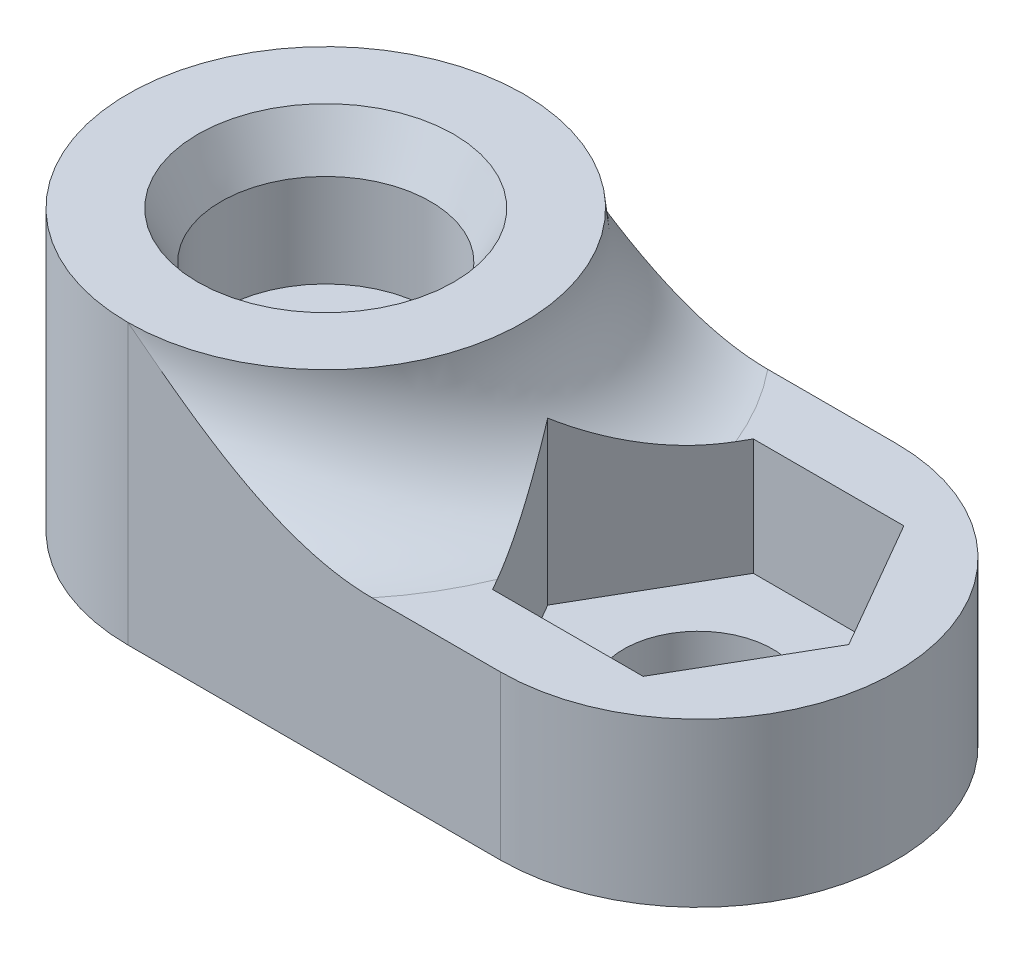
ISO-10303-21;
HEADER;
FILE_DESCRIPTION(('STEP AP214'),'2;1');
FILE_NAME('part.step','',(''),(''),'','','');
FILE_SCHEMA(('AUTOMOTIVE_DESIGN { 1 0 10303 214 1 1 1 1 }'));
ENDSEC;
DATA;
#1=APPLICATION_CONTEXT('core data for automotive mechanical design processes');
#2=APPLICATION_PROTOCOL_DEFINITION('international standard','automotive_design',2000,#1);
#3=PRODUCT_CONTEXT('',#1,'mechanical');
#4=PRODUCT('Part','Part','',(#3));
#5=PRODUCT_RELATED_PRODUCT_CATEGORY('part','',(#4));
#6=PRODUCT_DEFINITION_FORMATION('','',#4);
#7=PRODUCT_DEFINITION_CONTEXT('part definition',#1,'design');
#8=PRODUCT_DEFINITION('design','',#6,#7);
#9=PRODUCT_DEFINITION_SHAPE('','',#8);
#10=(LENGTH_UNIT() NAMED_UNIT(*) SI_UNIT(.MILLI.,.METRE.));
#11=(NAMED_UNIT(*) PLANE_ANGLE_UNIT() SI_UNIT($,.RADIAN.));
#12=(NAMED_UNIT(*) SI_UNIT($,.STERADIAN.) SOLID_ANGLE_UNIT());
#13=UNCERTAINTY_MEASURE_WITH_UNIT(LENGTH_MEASURE(1.E-05),#10,'distance_accuracy_value','');
#14=(GEOMETRIC_REPRESENTATION_CONTEXT(3) GLOBAL_UNCERTAINTY_ASSIGNED_CONTEXT((#13)) GLOBAL_UNIT_ASSIGNED_CONTEXT((#10,
#11,#12)) REPRESENTATION_CONTEXT('',''));
#15=CARTESIAN_POINT('',(0.,0.,0.));
#16=DIRECTION('',(0.,0.,1.));
#17=DIRECTION('',(1.,0.,0.));
#18=AXIS2_PLACEMENT_3D('',#15,#16,#17);
#19=CARTESIAN_POINT('',(-4.,6.,4.25));
#20=DIRECTION('',(0.,0.,-1.));
#21=DIRECTION('',(-1.,0.,0.));
#22=AXIS2_PLACEMENT_3D('',#19,#20,#21);
#23=PLANE('',#22);
#24=DIRECTION('',(1.,0.,0.));
#25=VECTOR('',#24,1.);
#26=CARTESIAN_POINT('',(-4.,3.5,4.25));
#27=LINE('',#26,#25);
#28=CARTESIAN_POINT('',(1.24404424085076,3.5,4.25));
#29=VERTEX_POINT('',#28);
#30=CARTESIAN_POINT('',(4.,3.5,4.25));
#31=VERTEX_POINT('',#30);
#32=EDGE_CURVE('E129',#29,#31,#27,.T.);
#33=ORIENTED_EDGE('',*,*,#32,.F.);
#34=CARTESIAN_POINT('',(1.24404424085076,3.5,4.25));
#35=CARTESIAN_POINT('',(1.10810369469074,3.50000373529834,4.25));
#36=CARTESIAN_POINT('',(0.972308352707414,3.50668920022554,4.25));
#37=CARTESIAN_POINT('',(0.702103297734981,3.53214344116817,4.25));
#38=CARTESIAN_POINT('',(0.567691406935837,3.5508887395514,4.25));
#39=CARTESIAN_POINT('',(0.171184944719958,3.62265462839746,4.25));
#40=CARTESIAN_POINT('',(-0.0880999173191222,3.6912817218382,4.25));
#41=CARTESIAN_POINT('',(-0.761211941456565,3.916832916689,4.25));
#42=CARTESIAN_POINT('',(-1.16527462955748,4.10215086489756,4.25));
#43=CARTESIAN_POINT('',(-1.7490638887413,4.42108288826862,4.25));
#44=CARTESIAN_POINT('',(-1.94067201163178,4.53476342555109,4.25));
#45=CARTESIAN_POINT('',(-2.31751508364871,4.77230159065795,4.25));
#46=CARTESIAN_POINT('',(-2.5027510754478,4.89615754213183,4.25));
#47=CARTESIAN_POINT('',(-3.12997398815831,5.33287181374285,4.25));
#48=CARTESIAN_POINT('',(-3.55998016095011,5.66252138297456,4.25));
#49=CARTESIAN_POINT('',(-3.99310276690116,5.99471006991551,4.25));
#50=CARTESIAN_POINT('',(-3.99655139050899,5.99735504361978,4.25));
#51=CARTESIAN_POINT('',(-4.,6.,4.25));
#52=B_SPLINE_CURVE_WITH_KNOTS('',3,(#34,#35,#36,#37,#38,#39,#40,#41,#42,#43,#44,#45,#46,#47,#48,
#49,#50,#51),.UNSPECIFIED.,.F.,.F.,(4,2,2,2,2,2,2,2,4),(0.,0.407433150558249,0.814075515832789,
1.61575218557037,2.94144234670956,3.60971583356349,4.27787944550394,5.90236182275991,
5.9154002275773),.UNSPECIFIED.);
#53=CARTESIAN_POINT('',(-4.,6.,4.25));
#54=VERTEX_POINT('',#53);
#55=EDGE_CURVE('E191',#29,#54,#52,.T.);
#56=ORIENTED_EDGE('',*,*,#55,.T.);
#57=DIRECTION('',(0.,-1.,0.));
#58=VECTOR('',#57,1.);
#59=CARTESIAN_POINT('',(-4.,6.,4.25));
#60=LINE('',#59,#58);
#61=CARTESIAN_POINT('',(-4.,0.,4.25));
#62=VERTEX_POINT('',#61);
#63=EDGE_CURVE('E146',#54,#62,#60,.T.);
#64=ORIENTED_EDGE('',*,*,#63,.T.);
#65=DIRECTION('',(1.,0.,0.));
#66=VECTOR('',#65,1.);
#67=CARTESIAN_POINT('',(-4.,0.,4.25));
#68=LINE('',#67,#66);
#69=CARTESIAN_POINT('',(4.,0.,4.25));
#70=VERTEX_POINT('',#69);
#71=EDGE_CURVE('E239',#62,#70,#68,.T.);
#72=ORIENTED_EDGE('',*,*,#71,.T.);
#73=DIRECTION('',(0.,-1.,0.));
#74=VECTOR('',#73,1.);
#75=CARTESIAN_POINT('',(4.,6.,4.25));
#76=LINE('',#75,#74);
#77=EDGE_CURVE('E144',#31,#70,#76,.T.);
#78=ORIENTED_EDGE('',*,*,#77,.F.);
#79=EDGE_LOOP('',(#33,#56,#64,#72,#78));
#80=FACE_BOUND('',#79,.T.);
#81=ADVANCED_FACE('F33',(#80),#23,.F.);
#82=CARTESIAN_POINT('',(4.,6.,0.));
#83=DIRECTION('',(0.,-1.,0.));
#84=DIRECTION('',(0.,0.,-1.));
#85=AXIS2_PLACEMENT_3D('',#82,#83,#84);
#86=CYLINDRICAL_SURFACE('',#85,4.25);
#87=CARTESIAN_POINT('',(4.,3.5,0.));
#88=DIRECTION('',(0.,1.,0.));
#89=DIRECTION('',(0.,0.,1.));
#90=AXIS2_PLACEMENT_3D('',#87,#88,#89);
#91=CIRCLE('',#90,4.25);
#92=CARTESIAN_POINT('',(4.,3.5,-4.25));
#93=VERTEX_POINT('',#92);
#94=EDGE_CURVE('E122',#31,#93,#91,.T.);
#95=ORIENTED_EDGE('',*,*,#94,.F.);
#96=ORIENTED_EDGE('',*,*,#77,.T.);
#97=CARTESIAN_POINT('',(4.,0.,0.));
#98=DIRECTION('',(0.,1.,0.));
#99=DIRECTION('',(0.,0.,1.));
#100=AXIS2_PLACEMENT_3D('',#97,#98,#99);
#101=CIRCLE('',#100,4.25);
#102=CARTESIAN_POINT('',(4.,0.,-4.25));
#103=VERTEX_POINT('',#102);
#104=EDGE_CURVE('E142',#70,#103,#101,.T.);
#105=ORIENTED_EDGE('',*,*,#104,.T.);
#106=DIRECTION('',(0.,-1.,0.));
#107=VECTOR('',#106,1.);
#108=CARTESIAN_POINT('',(4.,6.,-4.25));
#109=LINE('',#108,#107);
#110=EDGE_CURVE('E135',#93,#103,#109,.T.);
#111=ORIENTED_EDGE('',*,*,#110,.F.);
#112=EDGE_LOOP('',(#95,#96,#105,#111));
#113=FACE_BOUND('',#112,.T.);
#114=ADVANCED_FACE('F140',(#113),#86,.T.);
#115=CARTESIAN_POINT('',(-4.,6.,-4.25));
#116=DIRECTION('',(0.,0.,1.));
#117=DIRECTION('',(1.,0.,0.));
#118=AXIS2_PLACEMENT_3D('',#115,#116,#117);
#119=PLANE('',#118);
#120=DIRECTION('',(-1.,0.,0.));
#121=VECTOR('',#120,1.);
#122=CARTESIAN_POINT('',(4.,3.5,-4.25));
#123=LINE('',#122,#121);
#124=CARTESIAN_POINT('',(1.24404424085076,3.5,-4.25));
#125=VERTEX_POINT('',#124);
#126=EDGE_CURVE('E126',#93,#125,#123,.T.);
#127=ORIENTED_EDGE('',*,*,#126,.F.);
#128=ORIENTED_EDGE('',*,*,#110,.T.);
#129=DIRECTION('',(-1.,0.,0.));
#130=VECTOR('',#129,1.);
#131=CARTESIAN_POINT('',(-4.,0.,-4.25));
#132=LINE('',#131,#130);
#133=CARTESIAN_POINT('',(-4.,0.,-4.25));
#134=VERTEX_POINT('',#133);
#135=EDGE_CURVE('E232',#103,#134,#132,.T.);
#136=ORIENTED_EDGE('',*,*,#135,.T.);
#137=DIRECTION('',(0.,-1.,0.));
#138=VECTOR('',#137,1.);
#139=CARTESIAN_POINT('',(-4.,6.,-4.25));
#140=LINE('',#139,#138);
#141=CARTESIAN_POINT('',(-4.,6.,-4.25));
#142=VERTEX_POINT('',#141);
#143=EDGE_CURVE('E56',#142,#134,#140,.T.);
#144=ORIENTED_EDGE('',*,*,#143,.F.);
#145=CARTESIAN_POINT('',(1.24404424085076,3.5,-4.25));
#146=CARTESIAN_POINT('',(1.10810369469074,3.50000373529834,-4.25));
#147=CARTESIAN_POINT('',(0.972308352707407,3.50668920022554,-4.25));
#148=CARTESIAN_POINT('',(0.70210329773497,3.53214344116817,-4.25));
#149=CARTESIAN_POINT('',(0.567691406935824,3.5508887395514,-4.25));
#150=CARTESIAN_POINT('',(0.171184944719949,3.62265462839746,-4.25));
#151=CARTESIAN_POINT('',(-0.0880999173191279,3.6912817218382,-4.25));
#152=CARTESIAN_POINT('',(-0.761211941456561,3.916832916689,-4.25));
#153=CARTESIAN_POINT('',(-1.16527462955747,4.10215086489756,-4.25));
#154=CARTESIAN_POINT('',(-1.7490638887413,4.42108288826862,-4.25));
#155=CARTESIAN_POINT('',(-1.94067201163177,4.53476342555108,-4.25));
#156=CARTESIAN_POINT('',(-2.3175150836487,4.77230159065795,-4.25));
#157=CARTESIAN_POINT('',(-2.50275107544778,4.89615754213184,-4.25));
#158=CARTESIAN_POINT('',(-3.12997398815833,5.33287181374282,-4.25));
#159=CARTESIAN_POINT('',(-3.55998016095025,5.66252138297438,-4.25));
#160=CARTESIAN_POINT('',(-3.99310276690116,5.99471006991551,-4.25));
#161=CARTESIAN_POINT('',(-3.99655139050899,5.99735504361978,-4.25));
#162=CARTESIAN_POINT('',(-4.,6.,-4.25));
#163=B_SPLINE_CURVE_WITH_KNOTS('',3,(#145,#146,#147,#148,#149,#150,#151,#152,#153,#154,#155,
#156,#157,#158,#159,#160,#161,#162),.UNSPECIFIED.,.F.,.F.,(4,2,2,2,2,2,2,2,4),(0.,
0.407433150558256,0.814075515832802,1.61575218557036,2.94144234670955,3.60971583356348,
4.27787944550393,5.90236182275991,5.9154002275773),.UNSPECIFIED.);
#164=EDGE_CURVE('E138',#142,#125,#163,.F.);
#165=ORIENTED_EDGE('',*,*,#164,.T.);
#166=EDGE_LOOP('',(#127,#128,#136,#144,#165));
#167=FACE_BOUND('',#166,.T.);
#168=ADVANCED_FACE('F134',(#167),#119,.F.);
#169=CARTESIAN_POINT('',(5.61658075373095,1.,2.8));
#170=DIRECTION('',(0.866025403784438,0.,0.5));
#171=DIRECTION('',(0.5,0.,-0.866025403784439));
#172=AXIS2_PLACEMENT_3D('',#169,#170,#171);
#173=PLANE('',#172);
#174=DIRECTION('',(-0.5,0.,0.866025403784439));
#175=VECTOR('',#174,1.);
#176=CARTESIAN_POINT('',(5.61658075373095,3.5,2.8));
#177=LINE('',#176,#175);
#178=CARTESIAN_POINT('',(7.23316150746191,3.5,0.));
#179=VERTEX_POINT('',#178);
#180=CARTESIAN_POINT('',(5.61658075373095,3.5,2.8));
#181=VERTEX_POINT('',#180);
#182=EDGE_CURVE('E416',#179,#181,#177,.T.);
#183=ORIENTED_EDGE('',*,*,#182,.F.);
#184=DIRECTION('',(0.,1.,0.));
#185=VECTOR('',#184,1.);
#186=CARTESIAN_POINT('',(7.23316150746191,1.,0.));
#187=LINE('',#186,#185);
#188=CARTESIAN_POINT('',(7.23316150746191,1.,0.));
#189=VERTEX_POINT('',#188);
#190=EDGE_CURVE('E382',#189,#179,#187,.T.);
#191=ORIENTED_EDGE('',*,*,#190,.F.);
#192=DIRECTION('',(0.5,0.,-0.866025403784439));
#193=VECTOR('',#192,1.);
#194=CARTESIAN_POINT('',(5.61658075373095,1.,2.8));
#195=LINE('',#194,#193);
#196=CARTESIAN_POINT('',(5.61658075373095,1.,2.8));
#197=VERTEX_POINT('',#196);
#198=EDGE_CURVE('E409',#197,#189,#195,.T.);
#199=ORIENTED_EDGE('',*,*,#198,.F.);
#200=DIRECTION('',(0.,1.,0.));
#201=VECTOR('',#200,1.);
#202=CARTESIAN_POINT('',(5.61658075373095,1.,2.8));
#203=LINE('',#202,#201);
#204=EDGE_CURVE('E375',#197,#181,#203,.T.);
#205=ORIENTED_EDGE('',*,*,#204,.T.);
#206=EDGE_LOOP('',(#183,#191,#199,#205));
#207=FACE_BOUND('',#206,.T.);
#208=ADVANCED_FACE('F256',(#207),#173,.F.);
#209=CARTESIAN_POINT('',(2.38341924626905,1.,2.8));
#210=DIRECTION('',(0.,0.,1.));
#211=DIRECTION('',(1.,0.,0.));
#212=AXIS2_PLACEMENT_3D('',#209,#210,#211);
#213=PLANE('',#212);
#214=DIRECTION('',(-1.,0.,0.));
#215=VECTOR('',#214,1.);
#216=CARTESIAN_POINT('',(2.38341924626905,3.5,2.8));
#217=LINE('',#216,#215);
#218=CARTESIAN_POINT('',(2.38341924626905,3.5,2.8));
#219=VERTEX_POINT('',#218);
#220=EDGE_CURVE('E419',#181,#219,#217,.T.);
#221=ORIENTED_EDGE('',*,*,#220,.F.);
#222=ORIENTED_EDGE('',*,*,#204,.F.);
#223=DIRECTION('',(1.,0.,0.));
#224=VECTOR('',#223,1.);
#225=CARTESIAN_POINT('',(2.38341924626905,1.,2.8));
#226=LINE('',#225,#224);
#227=CARTESIAN_POINT('',(2.38341924626905,1.,2.8));
#228=VERTEX_POINT('',#227);
#229=EDGE_CURVE('E386',#228,#197,#226,.T.);
#230=ORIENTED_EDGE('',*,*,#229,.F.);
#231=DIRECTION('',(0.,1.,0.));
#232=VECTOR('',#231,1.);
#233=CARTESIAN_POINT('',(2.38341924626905,1.,2.8));
#234=LINE('',#233,#232);
#235=EDGE_CURVE('E379',#228,#219,#234,.T.);
#236=ORIENTED_EDGE('',*,*,#235,.T.);
#237=EDGE_LOOP('',(#221,#222,#230,#236));
#238=FACE_BOUND('',#237,.T.);
#239=ADVANCED_FACE('F261',(#238),#213,.F.);
#240=CARTESIAN_POINT('',(0.766838492538096,1.,0.));
#241=DIRECTION('',(-0.866025403784439,0.,0.5));
#242=DIRECTION('',(0.5,0.,0.866025403784439));
#243=AXIS2_PLACEMENT_3D('',#240,#241,#242);
#244=PLANE('',#243);
#245=DIRECTION('',(-0.5,0.,-0.866025403784439));
#246=VECTOR('',#245,1.);
#247=CARTESIAN_POINT('',(0.766838492538096,3.5,0.));
#248=LINE('',#247,#246);
#249=CARTESIAN_POINT('',(2.24535536211645,3.5,2.56086633795739));
#250=VERTEX_POINT('',#249);
#251=EDGE_CURVE('E421',#219,#250,#248,.T.);
#252=ORIENTED_EDGE('',*,*,#251,.F.);
#253=ORIENTED_EDGE('',*,*,#235,.F.);
#254=DIRECTION('',(0.5,0.,0.866025403784439));
#255=VECTOR('',#254,1.);
#256=CARTESIAN_POINT('',(0.766838492538096,1.,0.));
#257=LINE('',#256,#255);
#258=CARTESIAN_POINT('',(0.766838492538096,1.,0.));
#259=VERTEX_POINT('',#258);
#260=EDGE_CURVE('E397',#259,#228,#257,.T.);
#261=ORIENTED_EDGE('',*,*,#260,.F.);
#262=DIRECTION('',(0.,1.,0.));
#263=VECTOR('',#262,1.);
#264=CARTESIAN_POINT('',(0.766838492538096,1.,0.));
#265=LINE('',#264,#263);
#266=CARTESIAN_POINT('',(0.766838492538096,4.47780735932621,0.));
#267=VERTEX_POINT('',#266);
#268=EDGE_CURVE('E48',#259,#267,#265,.T.);
#269=ORIENTED_EDGE('',*,*,#268,.T.);
#270=CARTESIAN_POINT('',(0.766838492538096,4.47780735932621,0.));
#271=CARTESIAN_POINT('',(0.806979971242506,4.42552946597929,0.0695270806069799));
#272=CARTESIAN_POINT('',(0.847639636619182,4.37483669220918,0.139951686858131));
#273=CARTESIAN_POINT('',(0.92996543142611,4.27678785984553,0.282544146237221));
#274=CARTESIAN_POINT('',(0.971631800602003,4.22943260680985,0.35471241461679));
#275=CARTESIAN_POINT('',(1.05608288214946,4.13807630004476,0.500985978611127));
#276=CARTESIAN_POINT('',(1.09887126132079,4.09408876311847,0.575097625309393));
#277=CARTESIAN_POINT('',(1.18537209919397,4.0099422132226,0.724921471403021));
#278=CARTESIAN_POINT('',(1.22908449565245,3.96978294337219,0.8006335629897));
#279=CARTESIAN_POINT('',(1.35876989902924,3.85790090150424,1.02525527063837));
#280=CARTESIAN_POINT('',(1.4459913977252,3.79183039390045,1.17632733789207));
#281=CARTESIAN_POINT('',(1.62321325033044,3.67787796219826,1.48328459081583));
#282=CARTESIAN_POINT('',(1.71320812825547,3.6299624037551,1.63916029180294));
#283=CARTESIAN_POINT('',(1.87636744077898,3.56293971648729,1.92176051082166));
#284=CARTESIAN_POINT('',(1.94912435264408,3.53990715858,2.04777917877383));
#285=CARTESIAN_POINT('',(2.09633528669854,3.5083449200926,2.30275599598583));
#286=CARTESIAN_POINT('',(2.17079914309629,3.50000146488552,2.43173117859425));
#287=CARTESIAN_POINT('',(2.24535536211645,3.5,2.56086633795739));
#288=B_SPLINE_CURVE_WITH_KNOTS('',3,(#270,#271,#272,#273,#274,#275,#276,#277,#278,#279,#280,
#281,#282,#283,#284,#285,#286,#287),.UNSPECIFIED.,.F.,.F.,(4,2,2,2,2,2,2,2,4),(0.,
0.287396578000092,0.574862287341477,0.863427100813826,1.1519725376267,1.71067803338073,
2.26834333559797,2.70961723929042,3.15644629285671),.UNSPECIFIED.);
#289=EDGE_CURVE('E171',#267,#250,#288,.T.);
#290=ORIENTED_EDGE('',*,*,#289,.T.);
#291=EDGE_LOOP('',(#252,#253,#261,#269,#290));
#292=FACE_BOUND('',#291,.T.);
#293=ADVANCED_FACE('F287',(#292),#244,.F.);
#294=CARTESIAN_POINT('',(2.38341924626905,1.,-2.8));
#295=DIRECTION('',(-0.866025403784439,0.,-0.5));
#296=DIRECTION('',(-0.5,0.,0.866025403784439));
#297=AXIS2_PLACEMENT_3D('',#294,#295,#296);
#298=PLANE('',#297);
#299=DIRECTION('',(0.5,0.,-0.866025403784439));
#300=VECTOR('',#299,1.);
#301=CARTESIAN_POINT('',(2.38341924626905,3.5,-2.8));
#302=LINE('',#301,#300);
#303=CARTESIAN_POINT('',(2.24535536211645,3.5,-2.5608663379574));
#304=VERTEX_POINT('',#303);
#305=CARTESIAN_POINT('',(2.38341924626905,3.5,-2.8));
#306=VERTEX_POINT('',#305);
#307=EDGE_CURVE('E424',#304,#306,#302,.T.);
#308=ORIENTED_EDGE('',*,*,#307,.F.);
#309=CARTESIAN_POINT('',(2.24535536211645,3.5,-2.5608663379574));
#310=CARTESIAN_POINT('',(2.1386518497916,3.50002544341177,-2.37605043326471));
#311=CARTESIAN_POINT('',(2.03228556893531,3.51707763386974,-2.19181863060946));
#312=CARTESIAN_POINT('',(1.87527068460762,3.56440935799784,-1.91986087340935));
#313=CARTESIAN_POINT('',(1.82377619606505,3.58356336783666,-1.83066980294386));
#314=CARTESIAN_POINT('',(1.72149757742328,3.62841788399579,-1.65351803892835));
#315=CARTESIAN_POINT('',(1.67071365533229,3.65412026664479,-1.56555770565913));
#316=CARTESIAN_POINT('',(1.5455868531305,3.72545886027243,-1.34883172685702));
#317=CARTESIAN_POINT('',(1.47175661131143,3.77471847849082,-1.22095399689128));
#318=CARTESIAN_POINT('',(1.32627488931519,3.8848914394024,-0.968972262821186));
#319=CARTESIAN_POINT('',(1.25462494660488,3.94581279448426,-0.844870921687532));
#320=CARTESIAN_POINT('',(1.11192117638444,4.07958059037973,-0.597700741234095));
#321=CARTESIAN_POINT('',(1.0409296300142,4.15269252024871,-0.474739776012963));
#322=CARTESIAN_POINT('',(0.93652700203598,4.26946176996745,-0.293909119910972));
#323=CARTESIAN_POINT('',(0.902099047522551,4.30953513904567,-0.234278153493043));
#324=CARTESIAN_POINT('',(0.833941461654309,4.39197295729026,-0.116225751848009));
#325=CARTESIAN_POINT('',(0.800211745041798,4.4343371244317,-0.0578041689502406));
#326=CARTESIAN_POINT('',(0.766838492538096,4.47780735932622,0.));
#327=B_SPLINE_CURVE_WITH_KNOTS('',3,(#309,#310,#311,#312,#313,#314,#315,#316,#317,#318,#319,
#320,#321,#322,#323,#324,#325,#326),.UNSPECIFIED.,.F.,.F.,(4,2,2,2,2,2,2,2,4),(0.,
0.63850856170333,0.952540322630387,1.2666621655969,1.7330485408829,2.19975651228507,
2.67841921923753,2.91738622560714,3.15632387893702),.UNSPECIFIED.);
#328=EDGE_CURVE('E165',#304,#267,#327,.T.);
#329=ORIENTED_EDGE('',*,*,#328,.T.);
#330=ORIENTED_EDGE('',*,*,#268,.F.);
#331=DIRECTION('',(-0.5,0.,0.866025403784439));
#332=VECTOR('',#331,1.);
#333=CARTESIAN_POINT('',(2.38341924626905,1.,-2.8));
#334=LINE('',#333,#332);
#335=CARTESIAN_POINT('',(2.38341924626905,1.,-2.8));
#336=VERTEX_POINT('',#335);
#337=EDGE_CURVE('E400',#336,#259,#334,.T.);
#338=ORIENTED_EDGE('',*,*,#337,.F.);
#339=DIRECTION('',(0.,1.,0.));
#340=VECTOR('',#339,1.);
#341=CARTESIAN_POINT('',(2.38341924626905,1.,-2.8));
#342=LINE('',#341,#340);
#343=EDGE_CURVE('E389',#336,#306,#342,.T.);
#344=ORIENTED_EDGE('',*,*,#343,.T.);
#345=EDGE_LOOP('',(#308,#329,#330,#338,#344));
#346=FACE_BOUND('',#345,.T.);
#347=ADVANCED_FACE('F177',(#346),#298,.F.);
#348=CARTESIAN_POINT('',(5.61658075373095,1.,-2.8));
#349=DIRECTION('',(0.,0.,-1.));
#350=DIRECTION('',(-1.,0.,0.));
#351=AXIS2_PLACEMENT_3D('',#348,#349,#350);
#352=PLANE('',#351);
#353=DIRECTION('',(1.,0.,0.));
#354=VECTOR('',#353,1.);
#355=CARTESIAN_POINT('',(5.61658075373095,3.5,-2.8));
#356=LINE('',#355,#354);
#357=CARTESIAN_POINT('',(5.61658075373095,3.5,-2.8));
#358=VERTEX_POINT('',#357);
#359=EDGE_CURVE('E426',#306,#358,#356,.T.);
#360=ORIENTED_EDGE('',*,*,#359,.F.);
#361=ORIENTED_EDGE('',*,*,#343,.F.);
#362=DIRECTION('',(-1.,0.,0.));
#363=VECTOR('',#362,1.);
#364=CARTESIAN_POINT('',(5.61658075373095,1.,-2.8));
#365=LINE('',#364,#363);
#366=CARTESIAN_POINT('',(5.61658075373095,1.,-2.8));
#367=VERTEX_POINT('',#366);
#368=EDGE_CURVE('E403',#367,#336,#365,.T.);
#369=ORIENTED_EDGE('',*,*,#368,.F.);
#370=DIRECTION('',(0.,1.,0.));
#371=VECTOR('',#370,1.);
#372=CARTESIAN_POINT('',(5.61658075373095,1.,-2.8));
#373=LINE('',#372,#371);
#374=EDGE_CURVE('E385',#367,#358,#373,.T.);
#375=ORIENTED_EDGE('',*,*,#374,.T.);
#376=EDGE_LOOP('',(#360,#361,#369,#375));
#377=FACE_BOUND('',#376,.T.);
#378=ADVANCED_FACE('F217',(#377),#352,.F.);
#379=CARTESIAN_POINT('',(7.23316150746191,1.,0.));
#380=DIRECTION('',(0.866025403784439,0.,-0.5));
#381=DIRECTION('',(-0.5,0.,-0.866025403784439));
#382=AXIS2_PLACEMENT_3D('',#379,#380,#381);
#383=PLANE('',#382);
#384=DIRECTION('',(0.5,0.,0.866025403784439));
#385=VECTOR('',#384,1.);
#386=CARTESIAN_POINT('',(7.23316150746191,3.5,0.));
#387=LINE('',#386,#385);
#388=EDGE_CURVE('E159',#358,#179,#387,.T.);
#389=ORIENTED_EDGE('',*,*,#388,.F.);
#390=ORIENTED_EDGE('',*,*,#374,.F.);
#391=DIRECTION('',(-0.5,0.,-0.866025403784439));
#392=VECTOR('',#391,1.);
#393=CARTESIAN_POINT('',(7.23316150746191,1.,0.));
#394=LINE('',#393,#392);
#395=EDGE_CURVE('E406',#189,#367,#394,.T.);
#396=ORIENTED_EDGE('',*,*,#395,.F.);
#397=ORIENTED_EDGE('',*,*,#190,.T.);
#398=EDGE_LOOP('',(#389,#390,#396,#397));
#399=FACE_BOUND('',#398,.T.);
#400=ADVANCED_FACE('F208',(#399),#383,.F.);
#401=CARTESIAN_POINT('',(-4.,6.,0.));
#402=DIRECTION('',(0.,-1.,0.));
#403=DIRECTION('',(0.,0.,-1.));
#404=AXIS2_PLACEMENT_3D('',#401,#402,#403);
#405=CYLINDRICAL_SURFACE('',#404,4.25);
#406=ORIENTED_EDGE('',*,*,#63,.F.);
#407=CARTESIAN_POINT('',(-4.,6.,0.));
#408=DIRECTION('',(0.,1.,0.));
#409=DIRECTION('',(0.,0.,1.));
#410=AXIS2_PLACEMENT_3D('',#407,#408,#409);
#411=CIRCLE('',#410,4.25);
#412=EDGE_CURVE('E222',#142,#54,#411,.T.);
#413=ORIENTED_EDGE('',*,*,#412,.F.);
#414=ORIENTED_EDGE('',*,*,#143,.T.);
#415=CARTESIAN_POINT('',(-4.,0.,0.));
#416=DIRECTION('',(0.,1.,0.));
#417=DIRECTION('',(0.,0.,1.));
#418=AXIS2_PLACEMENT_3D('',#415,#416,#417);
#419=CIRCLE('',#418,4.25);
#420=EDGE_CURVE('E225',#134,#62,#419,.T.);
#421=ORIENTED_EDGE('',*,*,#420,.T.);
#422=EDGE_LOOP('',(#406,#413,#414,#421));
#423=FACE_BOUND('',#422,.T.);
#424=ADVANCED_FACE('F205',(#423),#405,.T.);
#425=CARTESIAN_POINT('',(-4.,6.,0.));
#426=DIRECTION('',(0.,1.,0.));
#427=DIRECTION('',(0.,0.,1.));
#428=AXIS2_PLACEMENT_3D('',#425,#426,#427);
#429=PLANE('',#428);
#430=EDGE_CURVE('E148',#54,#142,#411,.T.);
#431=ORIENTED_EDGE('',*,*,#430,.T.);
#432=ORIENTED_EDGE('',*,*,#412,.T.);
#433=EDGE_LOOP('',(#431,#432));
#434=FACE_BOUND('',#433,.T.);
#435=CARTESIAN_POINT('',(-4.,6.,0.));
#436=DIRECTION('',(0.,1.,0.));
#437=DIRECTION('',(0.,0.,1.));
#438=AXIS2_PLACEMENT_3D('',#435,#436,#437);
#439=CIRCLE('',#438,2.75);
#440=CARTESIAN_POINT('',(-4.,6.,2.75));
#441=VERTEX_POINT('',#440);
#442=EDGE_CURVE('E156',#441,#441,#439,.F.);
#443=ORIENTED_EDGE('',*,*,#442,.T.);
#444=EDGE_LOOP('',(#443));
#445=FACE_BOUND('',#444,.T.);
#446=ADVANCED_FACE('F207',(#434,#445),#429,.T.);
#447=CARTESIAN_POINT('',(-4.,0.,0.));
#448=DIRECTION('',(0.,1.,0.));
#449=DIRECTION('',(0.,0.,1.));
#450=AXIS2_PLACEMENT_3D('',#447,#448,#449);
#451=PLANE('',#450);
#452=CARTESIAN_POINT('',(4.,0.,0.));
#453=DIRECTION('',(0.,1.,0.));
#454=DIRECTION('',(0.,0.,1.));
#455=AXIS2_PLACEMENT_3D('',#452,#453,#454);
#456=CIRCLE('',#455,1.6);
#457=CARTESIAN_POINT('',(4.,0.,1.6));
#458=VERTEX_POINT('',#457);
#459=EDGE_CURVE('E412',#458,#458,#456,.T.);
#460=ORIENTED_EDGE('',*,*,#459,.T.);
#461=EDGE_LOOP('',(#460));
#462=FACE_BOUND('',#461,.T.);
#463=CARTESIAN_POINT('',(-4.,0.,0.));
#464=DIRECTION('',(0.,-1.,0.));
#465=DIRECTION('',(0.,0.,-1.));
#466=AXIS2_PLACEMENT_3D('',#463,#464,#465);
#467=CIRCLE('',#466,2.5);
#468=CARTESIAN_POINT('',(-4.,0.,-2.5));
#469=VERTEX_POINT('',#468);
#470=EDGE_CURVE('E374',#469,#469,#467,.T.);
#471=ORIENTED_EDGE('',*,*,#470,.F.);
#472=EDGE_LOOP('',(#471));
#473=FACE_BOUND('',#472,.T.);
#474=ORIENTED_EDGE('',*,*,#420,.F.);
#475=ORIENTED_EDGE('',*,*,#135,.F.);
#476=ORIENTED_EDGE('',*,*,#104,.F.);
#477=ORIENTED_EDGE('',*,*,#71,.F.);
#478=EDGE_LOOP('',(#474,#475,#476,#477));
#479=FACE_BOUND('',#478,.T.);
#480=ADVANCED_FACE('F214',(#462,#473,#479),#451,.F.);
#481=CARTESIAN_POINT('',(-4.,3.,0.));
#482=DIRECTION('',(0.,1.,0.));
#483=DIRECTION('',(0.,0.,1.));
#484=AXIS2_PLACEMENT_3D('',#481,#482,#483);
#485=CYLINDRICAL_SURFACE('',#484,2.25);
#486=CARTESIAN_POINT('',(-4.,4.99999999999999,0.));
#487=DIRECTION('',(0.,1.,0.));
#488=DIRECTION('',(0.,0.,1.));
#489=AXIS2_PLACEMENT_3D('',#486,#487,#488);
#490=CIRCLE('',#489,2.25);
#491=CARTESIAN_POINT('',(-4.,4.99999999999999,2.25));
#492=VERTEX_POINT('',#491);
#493=EDGE_CURVE('E153',#492,#492,#490,.T.);
#494=ORIENTED_EDGE('',*,*,#493,.T.);
#495=EDGE_LOOP('',(#494));
#496=FACE_BOUND('',#495,.T.);
#497=CARTESIAN_POINT('',(-4.,3.,0.));
#498=DIRECTION('',(0.,1.,0.));
#499=DIRECTION('',(0.,0.,1.));
#500=AXIS2_PLACEMENT_3D('',#497,#498,#499);
#501=CIRCLE('',#500,2.25);
#502=CARTESIAN_POINT('',(-4.,3.,2.25));
#503=VERTEX_POINT('',#502);
#504=EDGE_CURVE('E236',#503,#503,#501,.T.);
#505=ORIENTED_EDGE('',*,*,#504,.F.);
#506=EDGE_LOOP('',(#505));
#507=FACE_BOUND('',#506,.T.);
#508=ADVANCED_FACE('F243',(#496,#507),#485,.F.);
#509=CARTESIAN_POINT('',(-4.,3.,0.));
#510=DIRECTION('',(0.,1.,0.));
#511=DIRECTION('',(0.,0.,1.));
#512=AXIS2_PLACEMENT_3D('',#509,#510,#511);
#513=PLANE('',#512);
#514=CARTESIAN_POINT('',(-4.,3.,0.));
#515=DIRECTION('',(0.,1.,0.));
#516=DIRECTION('',(0.,0.,1.));
#517=AXIS2_PLACEMENT_3D('',#514,#515,#516);
#518=CIRCLE('',#517,1.35);
#519=CARTESIAN_POINT('',(-4.,3.,1.35));
#520=VERTEX_POINT('',#519);
#521=EDGE_CURVE('E372',#520,#520,#518,.T.);
#522=ORIENTED_EDGE('',*,*,#521,.F.);
#523=EDGE_LOOP('',(#522));
#524=FACE_BOUND('',#523,.T.);
#525=ORIENTED_EDGE('',*,*,#504,.T.);
#526=EDGE_LOOP('',(#525));
#527=FACE_BOUND('',#526,.T.);
#528=ADVANCED_FACE('F249',(#524,#527),#513,.T.);
#529=CARTESIAN_POINT('',(-4.,1.5,0.));
#530=DIRECTION('',(0.,-1.,0.));
#531=DIRECTION('',(0.,0.,-1.));
#532=AXIS2_PLACEMENT_3D('',#529,#530,#531);
#533=CYLINDRICAL_SURFACE('',#532,2.5);
#534=CARTESIAN_POINT('',(-4.,1.58,0.));
#535=DIRECTION('',(0.,-1.,0.));
#536=DIRECTION('',(0.,0.,-1.));
#537=AXIS2_PLACEMENT_3D('',#534,#535,#536);
#538=CIRCLE('',#537,2.5);
#539=CARTESIAN_POINT('',(-4.,1.58,-2.5));
#540=VERTEX_POINT('',#539);
#541=EDGE_CURVE('E11',#540,#540,#538,.F.);
#542=ORIENTED_EDGE('',*,*,#541,.T.);
#543=EDGE_LOOP('',(#542));
#544=FACE_BOUND('',#543,.T.);
#545=ORIENTED_EDGE('',*,*,#470,.T.);
#546=EDGE_LOOP('',(#545));
#547=FACE_BOUND('',#546,.T.);
#548=ADVANCED_FACE('F335',(#544,#547),#533,.F.);
#549=CARTESIAN_POINT('',(-4.,0.,0.));
#550=DIRECTION('',(0.,1.,0.));
#551=DIRECTION('',(0.,0.,1.));
#552=AXIS2_PLACEMENT_3D('',#549,#550,#551);
#553=CYLINDRICAL_SURFACE('',#552,1.35);
#554=CARTESIAN_POINT('',(-4.,2.5,0.));
#555=DIRECTION('',(0.,-1.,0.));
#556=DIRECTION('',(0.,0.,-1.));
#557=AXIS2_PLACEMENT_3D('',#554,#555,#556);
#558=CIRCLE('',#557,1.35);
#559=CARTESIAN_POINT('',(-4.,2.5,-1.35));
#560=VERTEX_POINT('',#559);
#561=EDGE_CURVE('E41',#560,#560,#558,.T.);
#562=ORIENTED_EDGE('',*,*,#561,.T.);
#563=EDGE_LOOP('',(#562));
#564=FACE_BOUND('',#563,.T.);
#565=ORIENTED_EDGE('',*,*,#521,.T.);
#566=EDGE_LOOP('',(#565));
#567=FACE_BOUND('',#566,.T.);
#568=ADVANCED_FACE('F340',(#564,#567),#553,.F.);
#569=CARTESIAN_POINT('',(0.,1.,0.));
#570=DIRECTION('',(0.,1.,0.));
#571=DIRECTION('',(0.,0.,1.));
#572=AXIS2_PLACEMENT_3D('',#569,#570,#571);
#573=PLANE('',#572);
#574=CARTESIAN_POINT('',(4.,1.,0.));
#575=DIRECTION('',(0.,1.,0.));
#576=DIRECTION('',(0.,0.,1.));
#577=AXIS2_PLACEMENT_3D('',#574,#575,#576);
#578=CIRCLE('',#577,1.6);
#579=CARTESIAN_POINT('',(4.,1.,1.6));
#580=VERTEX_POINT('',#579);
#581=EDGE_CURVE('E413',#580,#580,#578,.T.);
#582=ORIENTED_EDGE('',*,*,#581,.F.);
#583=EDGE_LOOP('',(#582));
#584=FACE_BOUND('',#583,.T.);
#585=ORIENTED_EDGE('',*,*,#198,.T.);
#586=ORIENTED_EDGE('',*,*,#395,.T.);
#587=ORIENTED_EDGE('',*,*,#368,.T.);
#588=ORIENTED_EDGE('',*,*,#337,.T.);
#589=ORIENTED_EDGE('',*,*,#260,.T.);
#590=ORIENTED_EDGE('',*,*,#229,.T.);
#591=EDGE_LOOP('',(#585,#586,#587,#588,#589,#590));
#592=FACE_BOUND('',#591,.T.);
#593=ADVANCED_FACE('F352',(#584,#592),#573,.T.);
#594=CARTESIAN_POINT('',(4.,0.,0.));
#595=DIRECTION('',(0.,1.,0.));
#596=DIRECTION('',(0.,0.,1.));
#597=AXIS2_PLACEMENT_3D('',#594,#595,#596);
#598=CYLINDRICAL_SURFACE('',#597,1.6);
#599=ORIENTED_EDGE('',*,*,#459,.F.);
#600=EDGE_LOOP('',(#599));
#601=FACE_BOUND('',#600,.T.);
#602=ORIENTED_EDGE('',*,*,#581,.T.);
#603=EDGE_LOOP('',(#602));
#604=FACE_BOUND('',#603,.T.);
#605=ADVANCED_FACE('F449',(#601,#604),#598,.F.);
#606=CARTESIAN_POINT('',(-4.,4.99999999999999,0.));
#607=DIRECTION('',(0.,1.,0.));
#608=DIRECTION('',(0.,0.,1.));
#609=AXIS2_PLACEMENT_3D('',#606,#607,#608);
#610=CONICAL_SURFACE('',#609,2.25,0.463647609000804);
#611=ORIENTED_EDGE('',*,*,#442,.F.);
#612=EDGE_LOOP('',(#611));
#613=FACE_BOUND('',#612,.T.);
#614=ORIENTED_EDGE('',*,*,#493,.F.);
#615=EDGE_LOOP('',(#614));
#616=FACE_BOUND('',#615,.T.);
#617=ADVANCED_FACE('F185',(#613,#616),#610,.F.);
#618=CARTESIAN_POINT('',(4.,3.5,0.));
#619=DIRECTION('',(0.,1.,0.));
#620=DIRECTION('',(0.,0.,1.));
#621=AXIS2_PLACEMENT_3D('',#618,#619,#620);
#622=PLANE('',#621);
#623=ORIENTED_EDGE('',*,*,#126,.T.);
#624=CARTESIAN_POINT('',(-4.,3.5,0.));
#625=DIRECTION('',(0.,1.,0.));
#626=DIRECTION('',(0.,0.,1.));
#627=AXIS2_PLACEMENT_3D('',#624,#625,#626);
#628=CIRCLE('',#627,6.75);
#629=EDGE_CURVE('E163',#125,#304,#628,.F.);
#630=ORIENTED_EDGE('',*,*,#629,.T.);
#631=ORIENTED_EDGE('',*,*,#307,.T.);
#632=ORIENTED_EDGE('',*,*,#359,.T.);
#633=ORIENTED_EDGE('',*,*,#388,.T.);
#634=ORIENTED_EDGE('',*,*,#182,.T.);
#635=ORIENTED_EDGE('',*,*,#220,.T.);
#636=ORIENTED_EDGE('',*,*,#251,.T.);
#637=CARTESIAN_POINT('',(-4.,3.5,0.));
#638=DIRECTION('',(0.,1.,0.));
#639=DIRECTION('',(0.,0.,1.));
#640=AXIS2_PLACEMENT_3D('',#637,#638,#639);
#641=CIRCLE('',#640,6.75);
#642=EDGE_CURVE('E161',#250,#29,#641,.F.);
#643=ORIENTED_EDGE('',*,*,#642,.T.);
#644=ORIENTED_EDGE('',*,*,#32,.T.);
#645=ORIENTED_EDGE('',*,*,#94,.T.);
#646=EDGE_LOOP('',(#623,#630,#631,#632,#633,#634,#635,#636,#643,#644,#645));
#647=FACE_BOUND('',#646,.T.);
#648=ADVANCED_FACE('F124',(#647),#622,.T.);
#649=CARTESIAN_POINT('',(-4.,6.,0.));
#650=DIRECTION('',(0.,1.,0.));
#651=DIRECTION('',(0.,0.,1.));
#652=AXIS2_PLACEMENT_3D('',#649,#650,#651);
#653=TOROIDAL_SURFACE('',#652,6.75,2.5);
#654=ORIENTED_EDGE('',*,*,#164,.F.);
#655=ORIENTED_EDGE('',*,*,#430,.F.);
#656=ORIENTED_EDGE('',*,*,#55,.F.);
#657=ORIENTED_EDGE('',*,*,#642,.F.);
#658=ORIENTED_EDGE('',*,*,#289,.F.);
#659=ORIENTED_EDGE('',*,*,#328,.F.);
#660=ORIENTED_EDGE('',*,*,#629,.F.);
#661=EDGE_LOOP('',(#654,#655,#656,#657,#658,#659,#660));
#662=FACE_BOUND('',#661,.T.);
#663=ADVANCED_FACE('F180',(#662),#653,.F.);
#664=CARTESIAN_POINT('',(-4.,2.5,0.));
#665=DIRECTION('',(0.,-1.,0.));
#666=DIRECTION('',(0.,0.,-1.));
#667=AXIS2_PLACEMENT_3D('',#664,#665,#666);
#668=CONICAL_SURFACE('',#667,1.35,0.896055384571344);
#669=ORIENTED_EDGE('',*,*,#541,.F.);
#670=EDGE_LOOP('',(#669));
#671=FACE_BOUND('',#670,.T.);
#672=ORIENTED_EDGE('',*,*,#561,.F.);
#673=EDGE_LOOP('',(#672));
#674=FACE_BOUND('',#673,.T.);
#675=ADVANCED_FACE('F35',(#671,#674),#668,.F.);
#676=CLOSED_SHELL('',(#81,#114,#168,#208,#239,#293,#347,#378,#400,#424,#446,#480,#508,#528,#548,
#568,#593,#605,#617,#648,#663,#675));
#677=MANIFOLD_SOLID_BREP('B2',#676);
#678=ADVANCED_BREP_SHAPE_REPRESENTATION('',(#18,#677),#14);
#679=SHAPE_DEFINITION_REPRESENTATION(#9,#678);
ENDSEC;
END-ISO-10303-21;
